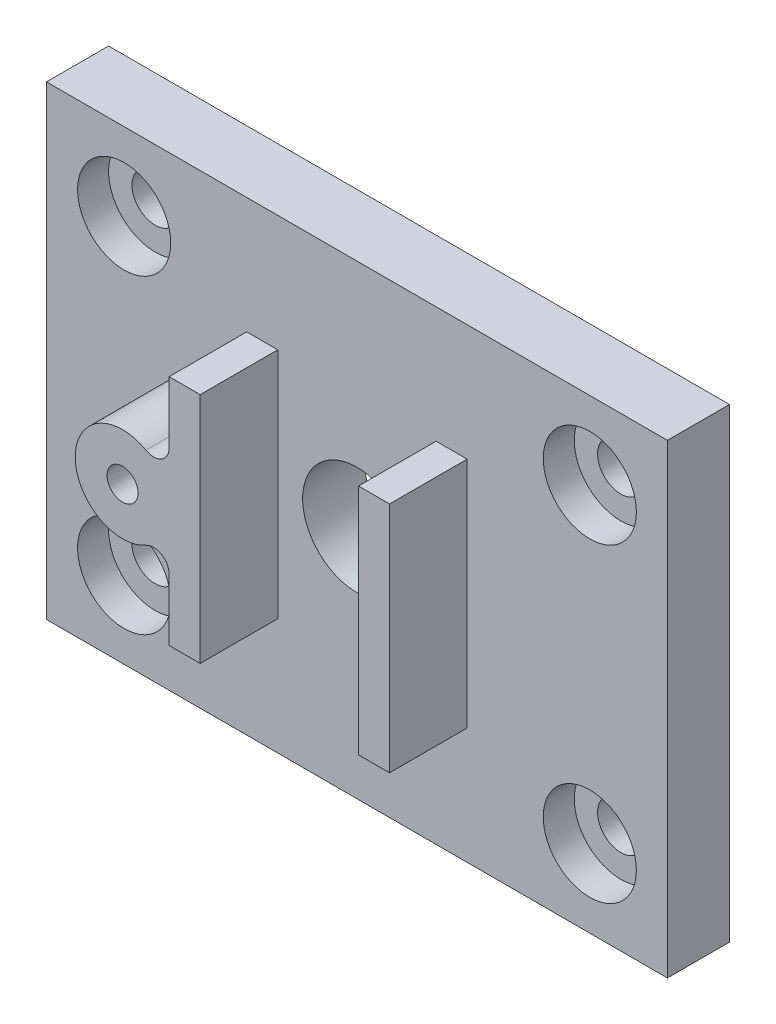
ISO-10303-21;
HEADER;
FILE_DESCRIPTION(('STEP AP214'),'2;1');
FILE_NAME('part.step','',(''),(''),'','','');
FILE_SCHEMA(('AUTOMOTIVE_DESIGN { 1 0 10303 214 1 1 1 1 }'));
ENDSEC;
DATA;
#1=APPLICATION_CONTEXT('core data for automotive mechanical design processes');
#2=APPLICATION_PROTOCOL_DEFINITION('international standard','automotive_design',2000,#1);
#3=PRODUCT_CONTEXT('',#1,'mechanical');
#4=PRODUCT('Part','Part','',(#3));
#5=PRODUCT_RELATED_PRODUCT_CATEGORY('part','',(#4));
#6=PRODUCT_DEFINITION_FORMATION('','',#4);
#7=PRODUCT_DEFINITION_CONTEXT('part definition',#1,'design');
#8=PRODUCT_DEFINITION('design','',#6,#7);
#9=PRODUCT_DEFINITION_SHAPE('','',#8);
#10=(LENGTH_UNIT() NAMED_UNIT(*) SI_UNIT(.MILLI.,.METRE.));
#11=(NAMED_UNIT(*) PLANE_ANGLE_UNIT() SI_UNIT($,.RADIAN.));
#12=(NAMED_UNIT(*) SI_UNIT($,.STERADIAN.) SOLID_ANGLE_UNIT());
#13=UNCERTAINTY_MEASURE_WITH_UNIT(LENGTH_MEASURE(1.E-05),#10,'distance_accuracy_value','');
#14=(GEOMETRIC_REPRESENTATION_CONTEXT(3) GLOBAL_UNCERTAINTY_ASSIGNED_CONTEXT((#13)) GLOBAL_UNIT_ASSIGNED_CONTEXT((#10,
#11,#12)) REPRESENTATION_CONTEXT('',''));
#15=CARTESIAN_POINT('',(0.,0.,0.));
#16=DIRECTION('',(0.,0.,1.));
#17=DIRECTION('',(1.,0.,0.));
#18=AXIS2_PLACEMENT_3D('',#15,#16,#17);
#19=CARTESIAN_POINT('',(0.,0.,4.));
#20=DIRECTION('',(0.,0.,1.));
#21=DIRECTION('',(1.,0.,0.));
#22=AXIS2_PLACEMENT_3D('',#19,#20,#21);
#23=PLANE('',#22);
#24=DIRECTION('',(0.,1.,0.));
#25=VECTOR('',#24,1.);
#26=CARTESIAN_POINT('',(25.1,0.,4.));
#27=LINE('',#26,#25);
#28=CARTESIAN_POINT('',(25.1,7.50000000000001,4.));
#29=VERTEX_POINT('',#28);
#30=CARTESIAN_POINT('',(25.1,22.5,4.));
#31=VERTEX_POINT('',#30);
#32=EDGE_CURVE('E154',#29,#31,#27,.T.);
#33=ORIENTED_EDGE('',*,*,#32,.T.);
#34=DIRECTION('',(1.,0.,0.));
#35=VECTOR('',#34,1.);
#36=CARTESIAN_POINT('',(0.,22.5,4.));
#37=LINE('',#36,#35);
#38=CARTESIAN_POINT('',(27.1,22.5,4.));
#39=VERTEX_POINT('',#38);
#40=EDGE_CURVE('E169',#31,#39,#37,.T.);
#41=ORIENTED_EDGE('',*,*,#40,.T.);
#42=DIRECTION('',(0.,-1.,0.));
#43=VECTOR('',#42,1.);
#44=CARTESIAN_POINT('',(27.1,0.,4.));
#45=LINE('',#44,#43);
#46=CARTESIAN_POINT('',(27.1,7.50000000000001,4.));
#47=VERTEX_POINT('',#46);
#48=EDGE_CURVE('E182',#39,#47,#45,.T.);
#49=ORIENTED_EDGE('',*,*,#48,.T.);
#50=DIRECTION('',(-1.,0.,0.));
#51=VECTOR('',#50,1.);
#52=CARTESIAN_POINT('',(0.,7.50000000000001,4.));
#53=LINE('',#52,#51);
#54=EDGE_CURVE('E180',#47,#29,#53,.T.);
#55=ORIENTED_EDGE('',*,*,#54,.T.);
#56=EDGE_LOOP('',(#33,#41,#49,#55));
#57=FACE_BOUND('',#56,.T.);
#58=DIRECTION('',(1.,0.,0.));
#59=VECTOR('',#58,1.);
#60=CARTESIAN_POINT('',(0.,0.,4.));
#61=LINE('',#60,#59);
#62=CARTESIAN_POINT('',(0.,0.,4.));
#63=VERTEX_POINT('',#62);
#64=CARTESIAN_POINT('',(40.,0.,4.));
#65=VERTEX_POINT('',#64);
#66=EDGE_CURVE('E268',#63,#65,#61,.T.);
#67=ORIENTED_EDGE('',*,*,#66,.T.);
#68=DIRECTION('',(0.,1.,0.));
#69=VECTOR('',#68,1.);
#70=CARTESIAN_POINT('',(40.,0.,4.));
#71=LINE('',#70,#69);
#72=CARTESIAN_POINT('',(40.,30.,4.));
#73=VERTEX_POINT('',#72);
#74=EDGE_CURVE('E271',#65,#73,#71,.T.);
#75=ORIENTED_EDGE('',*,*,#74,.T.);
#76=DIRECTION('',(1.,0.,0.));
#77=VECTOR('',#76,1.);
#78=CARTESIAN_POINT('',(0.,30.,4.));
#79=LINE('',#78,#77);
#80=CARTESIAN_POINT('',(0.,30.,4.));
#81=VERTEX_POINT('',#80);
#82=EDGE_CURVE('E273',#81,#73,#79,.T.);
#83=ORIENTED_EDGE('',*,*,#82,.F.);
#84=DIRECTION('',(0.,1.,0.));
#85=VECTOR('',#84,1.);
#86=CARTESIAN_POINT('',(0.,0.,4.));
#87=LINE('',#86,#85);
#88=EDGE_CURVE('E276',#63,#81,#87,.T.);
#89=ORIENTED_EDGE('',*,*,#88,.F.);
#90=EDGE_LOOP('',(#67,#75,#83,#89));
#91=FACE_BOUND('',#90,.T.);
#92=CARTESIAN_POINT('',(20.,15.,4.));
#93=DIRECTION('',(0.,0.,1.));
#94=DIRECTION('',(1.,0.,0.));
#95=AXIS2_PLACEMENT_3D('',#92,#93,#94);
#96=CIRCLE('',#95,3.5);
#97=CARTESIAN_POINT('',(23.5,15.,4.));
#98=VERTEX_POINT('',#97);
#99=EDGE_CURVE('E265',#98,#98,#96,.T.);
#100=ORIENTED_EDGE('',*,*,#99,.F.);
#101=EDGE_LOOP('',(#100));
#102=FACE_BOUND('',#101,.T.);
#103=CARTESIAN_POINT('',(5.,25.,4.));
#104=DIRECTION('',(0.,0.,1.));
#105=DIRECTION('',(1.,0.,0.));
#106=AXIS2_PLACEMENT_3D('',#103,#104,#105);
#107=CIRCLE('',#106,3.);
#108=CARTESIAN_POINT('',(8.,25.,4.));
#109=VERTEX_POINT('',#108);
#110=EDGE_CURVE('E262',#109,#109,#107,.T.);
#111=ORIENTED_EDGE('',*,*,#110,.F.);
#112=EDGE_LOOP('',(#111));
#113=FACE_BOUND('',#112,.T.);
#114=CARTESIAN_POINT('',(35.,25.,4.));
#115=DIRECTION('',(0.,0.,1.));
#116=DIRECTION('',(1.,0.,0.));
#117=AXIS2_PLACEMENT_3D('',#114,#115,#116);
#118=CIRCLE('',#117,3.);
#119=CARTESIAN_POINT('',(38.,25.,4.));
#120=VERTEX_POINT('',#119);
#121=EDGE_CURVE('E259',#120,#120,#118,.T.);
#122=ORIENTED_EDGE('',*,*,#121,.F.);
#123=EDGE_LOOP('',(#122));
#124=FACE_BOUND('',#123,.T.);
#125=CARTESIAN_POINT('',(35.,5.,4.));
#126=DIRECTION('',(0.,0.,1.));
#127=DIRECTION('',(1.,0.,0.));
#128=AXIS2_PLACEMENT_3D('',#125,#126,#127);
#129=CIRCLE('',#128,3.);
#130=CARTESIAN_POINT('',(38.,5.,4.));
#131=VERTEX_POINT('',#130);
#132=EDGE_CURVE('E255',#131,#131,#129,.T.);
#133=ORIENTED_EDGE('',*,*,#132,.F.);
#134=EDGE_LOOP('',(#133));
#135=FACE_BOUND('',#134,.T.);
#136=CARTESIAN_POINT('',(5.,5.,4.));
#137=DIRECTION('',(0.,0.,1.));
#138=DIRECTION('',(1.,0.,0.));
#139=AXIS2_PLACEMENT_3D('',#136,#137,#138);
#140=CIRCLE('',#139,3.);
#141=CARTESIAN_POINT('',(8.,5.,4.));
#142=VERTEX_POINT('',#141);
#143=EDGE_CURVE('E252',#142,#142,#140,.T.);
#144=ORIENTED_EDGE('',*,*,#143,.F.);
#145=EDGE_LOOP('',(#144));
#146=FACE_BOUND('',#145,.T.);
#147=CARTESIAN_POINT('',(9.9,15.,4.));
#148=DIRECTION('',(0.,0.,1.));
#149=DIRECTION('',(1.,0.,0.));
#150=AXIS2_PLACEMENT_3D('',#147,#148,#149);
#151=CIRCLE('',#150,3.05);
#152=CARTESIAN_POINT('',(11.4061728395062,17.6521582489614,4.));
#153=VERTEX_POINT('',#152);
#154=CARTESIAN_POINT('',(11.4061728395062,12.3478417510386,4.));
#155=VERTEX_POINT('',#154);
#156=EDGE_CURVE('E158',#153,#155,#151,.T.);
#157=ORIENTED_EDGE('',*,*,#156,.F.);
#158=CARTESIAN_POINT('',(11.9,18.5217183305881,4.));
#159=DIRECTION('',(0.,0.,1.));
#160=DIRECTION('',(1.,0.,0.));
#161=AXIS2_PLACEMENT_3D('',#158,#159,#160);
#162=CIRCLE('',#161,1.);
#163=CARTESIAN_POINT('',(12.9,18.5217183305881,4.));
#164=VERTEX_POINT('',#163);
#165=EDGE_CURVE('E323',#153,#164,#162,.T.);
#166=ORIENTED_EDGE('',*,*,#165,.T.);
#167=DIRECTION('',(0.,-1.,0.));
#168=VECTOR('',#167,1.);
#169=CARTESIAN_POINT('',(12.9,0.,4.));
#170=LINE('',#169,#168);
#171=CARTESIAN_POINT('',(12.9,22.5,4.));
#172=VERTEX_POINT('',#171);
#173=EDGE_CURVE('E194',#172,#164,#170,.T.);
#174=ORIENTED_EDGE('',*,*,#173,.F.);
#175=DIRECTION('',(-1.,0.,0.));
#176=VECTOR('',#175,1.);
#177=CARTESIAN_POINT('',(0.,22.5,4.));
#178=LINE('',#177,#176);
#179=CARTESIAN_POINT('',(14.9,22.5,4.));
#180=VERTEX_POINT('',#179);
#181=EDGE_CURVE('E213',#180,#172,#178,.T.);
#182=ORIENTED_EDGE('',*,*,#181,.F.);
#183=DIRECTION('',(0.,1.,0.));
#184=VECTOR('',#183,1.);
#185=CARTESIAN_POINT('',(14.9,0.,4.));
#186=LINE('',#185,#184);
#187=CARTESIAN_POINT('',(14.9,7.49999999999999,4.));
#188=VERTEX_POINT('',#187);
#189=EDGE_CURVE('E211',#188,#180,#186,.T.);
#190=ORIENTED_EDGE('',*,*,#189,.F.);
#191=DIRECTION('',(1.,0.,0.));
#192=VECTOR('',#191,1.);
#193=CARTESIAN_POINT('',(0.,7.49999999999999,4.));
#194=LINE('',#193,#192);
#195=CARTESIAN_POINT('',(12.9,7.49999999999999,4.));
#196=VERTEX_POINT('',#195);
#197=EDGE_CURVE('E209',#196,#188,#194,.T.);
#198=ORIENTED_EDGE('',*,*,#197,.F.);
#199=CARTESIAN_POINT('',(12.9,11.4782816694119,4.));
#200=VERTEX_POINT('',#199);
#201=EDGE_CURVE('E207',#200,#196,#170,.T.);
#202=ORIENTED_EDGE('',*,*,#201,.F.);
#203=CARTESIAN_POINT('',(11.9,11.4782816694119,4.));
#204=DIRECTION('',(0.,0.,1.));
#205=DIRECTION('',(1.,0.,0.));
#206=AXIS2_PLACEMENT_3D('',#203,#204,#205);
#207=CIRCLE('',#206,1.);
#208=EDGE_CURVE('E321',#200,#155,#207,.T.);
#209=ORIENTED_EDGE('',*,*,#208,.T.);
#210=EDGE_LOOP('',(#157,#166,#174,#182,#190,#198,#202,#209));
#211=FACE_BOUND('',#210,.T.);
#212=ADVANCED_FACE('F33',(#57,#91,#102,#113,#124,#135,#146,#211),#23,.T.);
#213=CARTESIAN_POINT('',(0.,0.,4.));
#214=DIRECTION('',(0.,1.,0.));
#215=DIRECTION('',(-1.,0.,0.));
#216=AXIS2_PLACEMENT_3D('',#213,#214,#215);
#217=PLANE('',#216);
#218=DIRECTION('',(1.,0.,0.));
#219=VECTOR('',#218,1.);
#220=CARTESIAN_POINT('',(0.,0.,0.));
#221=LINE('',#220,#219);
#222=CARTESIAN_POINT('',(0.,0.,0.));
#223=VERTEX_POINT('',#222);
#224=CARTESIAN_POINT('',(40.,0.,0.));
#225=VERTEX_POINT('',#224);
#226=EDGE_CURVE('E282',#223,#225,#221,.T.);
#227=ORIENTED_EDGE('',*,*,#226,.T.);
#228=DIRECTION('',(0.,0.,-1.));
#229=VECTOR('',#228,1.);
#230=CARTESIAN_POINT('',(40.,0.,4.));
#231=LINE('',#230,#229);
#232=EDGE_CURVE('E298',#65,#225,#231,.T.);
#233=ORIENTED_EDGE('',*,*,#232,.F.);
#234=ORIENTED_EDGE('',*,*,#66,.F.);
#235=DIRECTION('',(0.,0.,-1.));
#236=VECTOR('',#235,1.);
#237=CARTESIAN_POINT('',(0.,0.,4.));
#238=LINE('',#237,#236);
#239=EDGE_CURVE('E279',#63,#223,#238,.T.);
#240=ORIENTED_EDGE('',*,*,#239,.T.);
#241=EDGE_LOOP('',(#227,#233,#234,#240));
#242=FACE_BOUND('',#241,.T.);
#243=ADVANCED_FACE('F367',(#242),#217,.F.);
#244=CARTESIAN_POINT('',(40.,0.,4.));
#245=DIRECTION('',(-1.,0.,0.));
#246=DIRECTION('',(0.,-1.,0.));
#247=AXIS2_PLACEMENT_3D('',#244,#245,#246);
#248=PLANE('',#247);
#249=DIRECTION('',(0.,1.,0.));
#250=VECTOR('',#249,1.);
#251=CARTESIAN_POINT('',(40.,0.,0.));
#252=LINE('',#251,#250);
#253=CARTESIAN_POINT('',(40.,30.,0.));
#254=VERTEX_POINT('',#253);
#255=EDGE_CURVE('E285',#225,#254,#252,.T.);
#256=ORIENTED_EDGE('',*,*,#255,.T.);
#257=DIRECTION('',(0.,0.,-1.));
#258=VECTOR('',#257,1.);
#259=CARTESIAN_POINT('',(40.,30.,4.));
#260=LINE('',#259,#258);
#261=EDGE_CURVE('E296',#73,#254,#260,.T.);
#262=ORIENTED_EDGE('',*,*,#261,.F.);
#263=ORIENTED_EDGE('',*,*,#74,.F.);
#264=ORIENTED_EDGE('',*,*,#232,.T.);
#265=EDGE_LOOP('',(#256,#262,#263,#264));
#266=FACE_BOUND('',#265,.T.);
#267=ADVANCED_FACE('F374',(#266),#248,.F.);
#268=CARTESIAN_POINT('',(0.,30.,4.));
#269=DIRECTION('',(0.,1.,0.));
#270=DIRECTION('',(-1.,0.,0.));
#271=AXIS2_PLACEMENT_3D('',#268,#269,#270);
#272=PLANE('',#271);
#273=DIRECTION('',(1.,0.,0.));
#274=VECTOR('',#273,1.);
#275=CARTESIAN_POINT('',(0.,30.,0.));
#276=LINE('',#275,#274);
#277=CARTESIAN_POINT('',(0.,30.,0.));
#278=VERTEX_POINT('',#277);
#279=EDGE_CURVE('E288',#278,#254,#276,.T.);
#280=ORIENTED_EDGE('',*,*,#279,.F.);
#281=DIRECTION('',(0.,0.,-1.));
#282=VECTOR('',#281,1.);
#283=CARTESIAN_POINT('',(0.,30.,4.));
#284=LINE('',#283,#282);
#285=EDGE_CURVE('E294',#81,#278,#284,.T.);
#286=ORIENTED_EDGE('',*,*,#285,.F.);
#287=ORIENTED_EDGE('',*,*,#82,.T.);
#288=ORIENTED_EDGE('',*,*,#261,.T.);
#289=EDGE_LOOP('',(#280,#286,#287,#288));
#290=FACE_BOUND('',#289,.T.);
#291=ADVANCED_FACE('F490',(#290),#272,.T.);
#292=CARTESIAN_POINT('',(20.,15.,4.));
#293=DIRECTION('',(0.,0.,-1.));
#294=DIRECTION('',(-1.,0.,0.));
#295=AXIS2_PLACEMENT_3D('',#292,#293,#294);
#296=CYLINDRICAL_SURFACE('',#295,3.5);
#297=ORIENTED_EDGE('',*,*,#99,.T.);
#298=EDGE_LOOP('',(#297));
#299=FACE_BOUND('',#298,.T.);
#300=CARTESIAN_POINT('',(20.,15.,0.));
#301=DIRECTION('',(0.,0.,1.));
#302=DIRECTION('',(1.,0.,0.));
#303=AXIS2_PLACEMENT_3D('',#300,#301,#302);
#304=CIRCLE('',#303,3.5);
#305=CARTESIAN_POINT('',(23.5,15.,0.));
#306=VERTEX_POINT('',#305);
#307=EDGE_CURVE('E249',#306,#306,#304,.T.);
#308=ORIENTED_EDGE('',*,*,#307,.F.);
#309=EDGE_LOOP('',(#308));
#310=FACE_BOUND('',#309,.T.);
#311=ADVANCED_FACE('F460',(#299,#310),#296,.F.);
#312=CARTESIAN_POINT('',(5.,25.,4.));
#313=DIRECTION('',(0.,0.,-1.));
#314=DIRECTION('',(-1.,0.,0.));
#315=AXIS2_PLACEMENT_3D('',#312,#313,#314);
#316=CYLINDRICAL_SURFACE('',#315,3.);
#317=CARTESIAN_POINT('',(5.,25.,2.));
#318=DIRECTION('',(0.,0.,1.));
#319=DIRECTION('',(1.,0.,0.));
#320=AXIS2_PLACEMENT_3D('',#317,#318,#319);
#321=CIRCLE('',#320,3.);
#322=CARTESIAN_POINT('',(8.,25.,2.));
#323=VERTEX_POINT('',#322);
#324=EDGE_CURVE('E301',#323,#323,#321,.T.);
#325=ORIENTED_EDGE('',*,*,#324,.F.);
#326=EDGE_LOOP('',(#325));
#327=FACE_BOUND('',#326,.T.);
#328=ORIENTED_EDGE('',*,*,#110,.T.);
#329=EDGE_LOOP('',(#328));
#330=FACE_BOUND('',#329,.T.);
#331=ADVANCED_FACE('F456',(#327,#330),#316,.F.);
#332=CARTESIAN_POINT('',(35.,25.,4.));
#333=DIRECTION('',(0.,0.,-1.));
#334=DIRECTION('',(-1.,0.,0.));
#335=AXIS2_PLACEMENT_3D('',#332,#333,#334);
#336=CYLINDRICAL_SURFACE('',#335,3.);
#337=CARTESIAN_POINT('',(35.,25.,2.));
#338=DIRECTION('',(0.,0.,1.));
#339=DIRECTION('',(1.,0.,0.));
#340=AXIS2_PLACEMENT_3D('',#337,#338,#339);
#341=CIRCLE('',#340,3.);
#342=CARTESIAN_POINT('',(38.,25.,2.));
#343=VERTEX_POINT('',#342);
#344=EDGE_CURVE('E304',#343,#343,#341,.T.);
#345=ORIENTED_EDGE('',*,*,#344,.F.);
#346=EDGE_LOOP('',(#345));
#347=FACE_BOUND('',#346,.T.);
#348=ORIENTED_EDGE('',*,*,#121,.T.);
#349=EDGE_LOOP('',(#348));
#350=FACE_BOUND('',#349,.T.);
#351=ADVANCED_FACE('F459',(#347,#350),#336,.F.);
#352=CARTESIAN_POINT('',(35.,5.,4.));
#353=DIRECTION('',(0.,0.,-1.));
#354=DIRECTION('',(-1.,0.,0.));
#355=AXIS2_PLACEMENT_3D('',#352,#353,#354);
#356=CYLINDRICAL_SURFACE('',#355,3.);
#357=CARTESIAN_POINT('',(35.,5.,2.));
#358=DIRECTION('',(0.,0.,1.));
#359=DIRECTION('',(1.,0.,0.));
#360=AXIS2_PLACEMENT_3D('',#357,#358,#359);
#361=CIRCLE('',#360,3.);
#362=CARTESIAN_POINT('',(38.,5.,2.));
#363=VERTEX_POINT('',#362);
#364=EDGE_CURVE('E307',#363,#363,#361,.T.);
#365=ORIENTED_EDGE('',*,*,#364,.F.);
#366=EDGE_LOOP('',(#365));
#367=FACE_BOUND('',#366,.T.);
#368=ORIENTED_EDGE('',*,*,#132,.T.);
#369=EDGE_LOOP('',(#368));
#370=FACE_BOUND('',#369,.T.);
#371=ADVANCED_FACE('F473',(#367,#370),#356,.F.);
#372=CARTESIAN_POINT('',(5.,5.,4.));
#373=DIRECTION('',(0.,0.,-1.));
#374=DIRECTION('',(-1.,0.,0.));
#375=AXIS2_PLACEMENT_3D('',#372,#373,#374);
#376=CYLINDRICAL_SURFACE('',#375,3.);
#377=CARTESIAN_POINT('',(5.,5.,2.));
#378=DIRECTION('',(0.,0.,1.));
#379=DIRECTION('',(1.,0.,0.));
#380=AXIS2_PLACEMENT_3D('',#377,#378,#379);
#381=CIRCLE('',#380,3.);
#382=CARTESIAN_POINT('',(8.,5.,2.));
#383=VERTEX_POINT('',#382);
#384=EDGE_CURVE('E310',#383,#383,#381,.T.);
#385=ORIENTED_EDGE('',*,*,#384,.F.);
#386=EDGE_LOOP('',(#385));
#387=FACE_BOUND('',#386,.T.);
#388=ORIENTED_EDGE('',*,*,#143,.T.);
#389=EDGE_LOOP('',(#388));
#390=FACE_BOUND('',#389,.T.);
#391=ADVANCED_FACE('F471',(#387,#390),#376,.F.);
#392=CARTESIAN_POINT('',(0.,0.,4.));
#393=DIRECTION('',(-1.,0.,0.));
#394=DIRECTION('',(0.,-1.,0.));
#395=AXIS2_PLACEMENT_3D('',#392,#393,#394);
#396=PLANE('',#395);
#397=DIRECTION('',(0.,1.,0.));
#398=VECTOR('',#397,1.);
#399=CARTESIAN_POINT('',(0.,0.,0.));
#400=LINE('',#399,#398);
#401=EDGE_CURVE('E256',#223,#278,#400,.T.);
#402=ORIENTED_EDGE('',*,*,#401,.F.);
#403=ORIENTED_EDGE('',*,*,#239,.F.);
#404=ORIENTED_EDGE('',*,*,#88,.T.);
#405=ORIENTED_EDGE('',*,*,#285,.T.);
#406=EDGE_LOOP('',(#402,#403,#404,#405));
#407=FACE_BOUND('',#406,.T.);
#408=ADVANCED_FACE('F438',(#407),#396,.T.);
#409=CARTESIAN_POINT('',(0.,0.,0.));
#410=DIRECTION('',(0.,0.,1.));
#411=DIRECTION('',(1.,0.,0.));
#412=AXIS2_PLACEMENT_3D('',#409,#410,#411);
#413=PLANE('',#412);
#414=ORIENTED_EDGE('',*,*,#307,.T.);
#415=EDGE_LOOP('',(#414));
#416=FACE_BOUND('',#415,.T.);
#417=ORIENTED_EDGE('',*,*,#226,.F.);
#418=ORIENTED_EDGE('',*,*,#401,.T.);
#419=ORIENTED_EDGE('',*,*,#279,.T.);
#420=ORIENTED_EDGE('',*,*,#255,.F.);
#421=EDGE_LOOP('',(#417,#418,#419,#420));
#422=FACE_BOUND('',#421,.T.);
#423=CARTESIAN_POINT('',(5.,25.,0.));
#424=DIRECTION('',(0.,0.,1.));
#425=DIRECTION('',(1.,0.,0.));
#426=AXIS2_PLACEMENT_3D('',#423,#424,#425);
#427=CIRCLE('',#426,1.5);
#428=CARTESIAN_POINT('',(6.5,25.,0.));
#429=VERTEX_POINT('',#428);
#430=EDGE_CURVE('E243',#429,#429,#427,.T.);
#431=ORIENTED_EDGE('',*,*,#430,.T.);
#432=EDGE_LOOP('',(#431));
#433=FACE_BOUND('',#432,.T.);
#434=CARTESIAN_POINT('',(35.,25.,0.));
#435=DIRECTION('',(0.,0.,1.));
#436=DIRECTION('',(1.,0.,0.));
#437=AXIS2_PLACEMENT_3D('',#434,#435,#436);
#438=CIRCLE('',#437,1.5);
#439=CARTESIAN_POINT('',(36.5,25.,0.));
#440=VERTEX_POINT('',#439);
#441=EDGE_CURVE('E237',#440,#440,#438,.T.);
#442=ORIENTED_EDGE('',*,*,#441,.T.);
#443=EDGE_LOOP('',(#442));
#444=FACE_BOUND('',#443,.T.);
#445=CARTESIAN_POINT('',(35.,5.,0.));
#446=DIRECTION('',(0.,0.,1.));
#447=DIRECTION('',(1.,0.,0.));
#448=AXIS2_PLACEMENT_3D('',#445,#446,#447);
#449=CIRCLE('',#448,1.5);
#450=CARTESIAN_POINT('',(36.5,5.,0.));
#451=VERTEX_POINT('',#450);
#452=EDGE_CURVE('E231',#451,#451,#449,.T.);
#453=ORIENTED_EDGE('',*,*,#452,.T.);
#454=EDGE_LOOP('',(#453));
#455=FACE_BOUND('',#454,.T.);
#456=CARTESIAN_POINT('',(5.,5.,0.));
#457=DIRECTION('',(0.,0.,1.));
#458=DIRECTION('',(1.,0.,0.));
#459=AXIS2_PLACEMENT_3D('',#456,#457,#458);
#460=CIRCLE('',#459,1.5);
#461=CARTESIAN_POINT('',(6.5,5.,0.));
#462=VERTEX_POINT('',#461);
#463=EDGE_CURVE('E227',#462,#462,#460,.T.);
#464=ORIENTED_EDGE('',*,*,#463,.T.);
#465=EDGE_LOOP('',(#464));
#466=FACE_BOUND('',#465,.T.);
#467=ADVANCED_FACE('F433',(#416,#422,#433,#444,#455,#466),#413,.F.);
#468=CARTESIAN_POINT('',(5.,25.,2.));
#469=DIRECTION('',(0.,0.,-1.));
#470=DIRECTION('',(-1.,0.,0.));
#471=AXIS2_PLACEMENT_3D('',#468,#469,#470);
#472=CYLINDRICAL_SURFACE('',#471,1.5);
#473=CARTESIAN_POINT('',(5.,25.,2.));
#474=DIRECTION('',(0.,0.,1.));
#475=DIRECTION('',(1.,0.,0.));
#476=AXIS2_PLACEMENT_3D('',#473,#474,#475);
#477=CIRCLE('',#476,1.5);
#478=CARTESIAN_POINT('',(6.5,25.,2.));
#479=VERTEX_POINT('',#478);
#480=EDGE_CURVE('E246',#479,#479,#477,.T.);
#481=ORIENTED_EDGE('',*,*,#480,.T.);
#482=EDGE_LOOP('',(#481));
#483=FACE_BOUND('',#482,.T.);
#484=ORIENTED_EDGE('',*,*,#430,.F.);
#485=EDGE_LOOP('',(#484));
#486=FACE_BOUND('',#485,.T.);
#487=ADVANCED_FACE('F430',(#483,#486),#472,.F.);
#488=CARTESIAN_POINT('',(0.,0.,2.));
#489=DIRECTION('',(0.,0.,1.));
#490=DIRECTION('',(1.,0.,0.));
#491=AXIS2_PLACEMENT_3D('',#488,#489,#490);
#492=PLANE('',#491);
#493=ORIENTED_EDGE('',*,*,#480,.F.);
#494=EDGE_LOOP('',(#493));
#495=FACE_BOUND('',#494,.T.);
#496=ORIENTED_EDGE('',*,*,#324,.T.);
#497=EDGE_LOOP('',(#496));
#498=FACE_BOUND('',#497,.T.);
#499=ADVANCED_FACE('F427',(#495,#498),#492,.T.);
#500=CARTESIAN_POINT('',(35.,25.,2.));
#501=DIRECTION('',(0.,0.,-1.));
#502=DIRECTION('',(-1.,0.,0.));
#503=AXIS2_PLACEMENT_3D('',#500,#501,#502);
#504=CYLINDRICAL_SURFACE('',#503,1.5);
#505=CARTESIAN_POINT('',(35.,25.,2.));
#506=DIRECTION('',(0.,0.,1.));
#507=DIRECTION('',(1.,0.,0.));
#508=AXIS2_PLACEMENT_3D('',#505,#506,#507);
#509=CIRCLE('',#508,1.5);
#510=CARTESIAN_POINT('',(36.5,25.,2.));
#511=VERTEX_POINT('',#510);
#512=EDGE_CURVE('E240',#511,#511,#509,.T.);
#513=ORIENTED_EDGE('',*,*,#512,.T.);
#514=EDGE_LOOP('',(#513));
#515=FACE_BOUND('',#514,.T.);
#516=ORIENTED_EDGE('',*,*,#441,.F.);
#517=EDGE_LOOP('',(#516));
#518=FACE_BOUND('',#517,.T.);
#519=ADVANCED_FACE('F423',(#515,#518),#504,.F.);
#520=CARTESIAN_POINT('',(0.,0.,2.));
#521=DIRECTION('',(0.,0.,1.));
#522=DIRECTION('',(1.,0.,0.));
#523=AXIS2_PLACEMENT_3D('',#520,#521,#522);
#524=PLANE('',#523);
#525=ORIENTED_EDGE('',*,*,#512,.F.);
#526=EDGE_LOOP('',(#525));
#527=FACE_BOUND('',#526,.T.);
#528=ORIENTED_EDGE('',*,*,#344,.T.);
#529=EDGE_LOOP('',(#528));
#530=FACE_BOUND('',#529,.T.);
#531=ADVANCED_FACE('F419',(#527,#530),#524,.T.);
#532=CARTESIAN_POINT('',(35.,5.,2.));
#533=DIRECTION('',(0.,0.,-1.));
#534=DIRECTION('',(-1.,0.,0.));
#535=AXIS2_PLACEMENT_3D('',#532,#533,#534);
#536=CYLINDRICAL_SURFACE('',#535,1.5);
#537=CARTESIAN_POINT('',(35.,5.,2.));
#538=DIRECTION('',(0.,0.,1.));
#539=DIRECTION('',(1.,0.,0.));
#540=AXIS2_PLACEMENT_3D('',#537,#538,#539);
#541=CIRCLE('',#540,1.5);
#542=CARTESIAN_POINT('',(36.5,5.,2.));
#543=VERTEX_POINT('',#542);
#544=EDGE_CURVE('E234',#543,#543,#541,.T.);
#545=ORIENTED_EDGE('',*,*,#544,.T.);
#546=EDGE_LOOP('',(#545));
#547=FACE_BOUND('',#546,.T.);
#548=ORIENTED_EDGE('',*,*,#452,.F.);
#549=EDGE_LOOP('',(#548));
#550=FACE_BOUND('',#549,.T.);
#551=ADVANCED_FACE('F415',(#547,#550),#536,.F.);
#552=CARTESIAN_POINT('',(0.,0.,2.));
#553=DIRECTION('',(0.,0.,1.));
#554=DIRECTION('',(1.,0.,0.));
#555=AXIS2_PLACEMENT_3D('',#552,#553,#554);
#556=PLANE('',#555);
#557=ORIENTED_EDGE('',*,*,#544,.F.);
#558=EDGE_LOOP('',(#557));
#559=FACE_BOUND('',#558,.T.);
#560=ORIENTED_EDGE('',*,*,#364,.T.);
#561=EDGE_LOOP('',(#560));
#562=FACE_BOUND('',#561,.T.);
#563=ADVANCED_FACE('F411',(#559,#562),#556,.T.);
#564=CARTESIAN_POINT('',(5.,5.,2.));
#565=DIRECTION('',(0.,0.,-1.));
#566=DIRECTION('',(-1.,0.,0.));
#567=AXIS2_PLACEMENT_3D('',#564,#565,#566);
#568=CYLINDRICAL_SURFACE('',#567,1.5);
#569=CARTESIAN_POINT('',(5.,5.,2.));
#570=DIRECTION('',(0.,0.,1.));
#571=DIRECTION('',(1.,0.,0.));
#572=AXIS2_PLACEMENT_3D('',#569,#570,#571);
#573=CIRCLE('',#572,1.5);
#574=CARTESIAN_POINT('',(6.5,5.,2.));
#575=VERTEX_POINT('',#574);
#576=EDGE_CURVE('E228',#575,#575,#573,.T.);
#577=ORIENTED_EDGE('',*,*,#576,.T.);
#578=EDGE_LOOP('',(#577));
#579=FACE_BOUND('',#578,.T.);
#580=ORIENTED_EDGE('',*,*,#463,.F.);
#581=EDGE_LOOP('',(#580));
#582=FACE_BOUND('',#581,.T.);
#583=ADVANCED_FACE('F407',(#579,#582),#568,.F.);
#584=CARTESIAN_POINT('',(0.,0.,2.));
#585=DIRECTION('',(0.,0.,1.));
#586=DIRECTION('',(1.,0.,0.));
#587=AXIS2_PLACEMENT_3D('',#584,#585,#586);
#588=PLANE('',#587);
#589=ORIENTED_EDGE('',*,*,#576,.F.);
#590=EDGE_LOOP('',(#589));
#591=FACE_BOUND('',#590,.T.);
#592=ORIENTED_EDGE('',*,*,#384,.T.);
#593=EDGE_LOOP('',(#592));
#594=FACE_BOUND('',#593,.T.);
#595=ADVANCED_FACE('F404',(#591,#594),#588,.T.);
#596=CARTESIAN_POINT('',(9.9,15.,9.));
#597=DIRECTION('',(0.,0.,-1.));
#598=DIRECTION('',(-1.,0.,0.));
#599=AXIS2_PLACEMENT_3D('',#596,#597,#598);
#600=CYLINDRICAL_SURFACE('',#599,3.05);
#601=CARTESIAN_POINT('',(9.9,15.,9.));
#602=DIRECTION('',(0.,0.,1.));
#603=DIRECTION('',(1.,0.,0.));
#604=AXIS2_PLACEMENT_3D('',#601,#602,#603);
#605=CIRCLE('',#604,3.05);
#606=CARTESIAN_POINT('',(11.4061728395062,17.6521582489614,9.));
#607=VERTEX_POINT('',#606);
#608=CARTESIAN_POINT('',(11.4061728395062,12.3478417510386,9.));
#609=VERTEX_POINT('',#608);
#610=EDGE_CURVE('E193',#607,#609,#605,.T.);
#611=ORIENTED_EDGE('',*,*,#610,.F.);
#612=DIRECTION('',(0.,0.,-1.));
#613=VECTOR('',#612,1.);
#614=CARTESIAN_POINT('',(11.4061728395062,17.6521582489614,9.));
#615=LINE('',#614,#613);
#616=EDGE_CURVE('E318',#607,#153,#615,.T.);
#617=ORIENTED_EDGE('',*,*,#616,.T.);
#618=ORIENTED_EDGE('',*,*,#156,.T.);
#619=DIRECTION('',(0.,0.,-1.));
#620=VECTOR('',#619,1.);
#621=CARTESIAN_POINT('',(11.4061728395062,12.3478417510386,9.));
#622=LINE('',#621,#620);
#623=EDGE_CURVE('E316',#155,#609,#622,.F.);
#624=ORIENTED_EDGE('',*,*,#623,.T.);
#625=EDGE_LOOP('',(#611,#617,#618,#624));
#626=FACE_BOUND('',#625,.T.);
#627=ADVANCED_FACE('F334',(#626),#600,.T.);
#628=CARTESIAN_POINT('',(12.9,0.,9.));
#629=DIRECTION('',(1.,0.,0.));
#630=DIRECTION('',(0.,1.,0.));
#631=AXIS2_PLACEMENT_3D('',#628,#629,#630);
#632=PLANE('',#631);
#633=DIRECTION('',(0.,-1.,0.));
#634=VECTOR('',#633,1.);
#635=CARTESIAN_POINT('',(12.9,0.,9.));
#636=LINE('',#635,#634);
#637=CARTESIAN_POINT('',(12.9,11.4782816694119,9.));
#638=VERTEX_POINT('',#637);
#639=CARTESIAN_POINT('',(12.9,7.49999999999999,9.));
#640=VERTEX_POINT('',#639);
#641=EDGE_CURVE('E196',#638,#640,#636,.T.);
#642=ORIENTED_EDGE('',*,*,#641,.F.);
#643=DIRECTION('',(0.,0.,1.));
#644=VECTOR('',#643,1.);
#645=CARTESIAN_POINT('',(12.9,11.4782816694119,4.));
#646=LINE('',#645,#644);
#647=EDGE_CURVE('E326',#638,#200,#646,.F.);
#648=ORIENTED_EDGE('',*,*,#647,.T.);
#649=ORIENTED_EDGE('',*,*,#201,.T.);
#650=DIRECTION('',(0.,0.,-1.));
#651=VECTOR('',#650,1.);
#652=CARTESIAN_POINT('',(12.9,7.49999999999999,9.));
#653=LINE('',#652,#651);
#654=EDGE_CURVE('E224',#640,#196,#653,.T.);
#655=ORIENTED_EDGE('',*,*,#654,.F.);
#656=EDGE_LOOP('',(#642,#648,#649,#655));
#657=FACE_BOUND('',#656,.T.);
#658=ADVANCED_FACE('F359',(#657),#632,.F.);
#659=CARTESIAN_POINT('',(0.,7.49999999999999,9.));
#660=DIRECTION('',(0.,1.,0.));
#661=DIRECTION('',(0.,0.,1.));
#662=AXIS2_PLACEMENT_3D('',#659,#660,#661);
#663=PLANE('',#662);
#664=ORIENTED_EDGE('',*,*,#197,.T.);
#665=DIRECTION('',(0.,0.,-1.));
#666=VECTOR('',#665,1.);
#667=CARTESIAN_POINT('',(14.9,7.49999999999999,9.));
#668=LINE('',#667,#666);
#669=CARTESIAN_POINT('',(14.9,7.49999999999999,9.));
#670=VERTEX_POINT('',#669);
#671=EDGE_CURVE('E221',#670,#188,#668,.T.);
#672=ORIENTED_EDGE('',*,*,#671,.F.);
#673=DIRECTION('',(1.,0.,0.));
#674=VECTOR('',#673,1.);
#675=CARTESIAN_POINT('',(0.,7.49999999999999,9.));
#676=LINE('',#675,#674);
#677=EDGE_CURVE('E198',#640,#670,#676,.T.);
#678=ORIENTED_EDGE('',*,*,#677,.F.);
#679=ORIENTED_EDGE('',*,*,#654,.T.);
#680=EDGE_LOOP('',(#664,#672,#678,#679));
#681=FACE_BOUND('',#680,.T.);
#682=ADVANCED_FACE('F356',(#681),#663,.F.);
#683=CARTESIAN_POINT('',(14.9,0.,9.));
#684=DIRECTION('',(-1.,0.,0.));
#685=DIRECTION('',(0.,0.,1.));
#686=AXIS2_PLACEMENT_3D('',#683,#684,#685);
#687=PLANE('',#686);
#688=ORIENTED_EDGE('',*,*,#189,.T.);
#689=DIRECTION('',(0.,0.,-1.));
#690=VECTOR('',#689,1.);
#691=CARTESIAN_POINT('',(14.9,22.5,9.));
#692=LINE('',#691,#690);
#693=CARTESIAN_POINT('',(14.9,22.5,9.));
#694=VERTEX_POINT('',#693);
#695=EDGE_CURVE('E218',#694,#180,#692,.T.);
#696=ORIENTED_EDGE('',*,*,#695,.F.);
#697=DIRECTION('',(0.,1.,0.));
#698=VECTOR('',#697,1.);
#699=CARTESIAN_POINT('',(14.9,0.,9.));
#700=LINE('',#699,#698);
#701=EDGE_CURVE('E201',#670,#694,#700,.T.);
#702=ORIENTED_EDGE('',*,*,#701,.F.);
#703=ORIENTED_EDGE('',*,*,#671,.T.);
#704=EDGE_LOOP('',(#688,#696,#702,#703));
#705=FACE_BOUND('',#704,.T.);
#706=ADVANCED_FACE('F351',(#705),#687,.F.);
#707=CARTESIAN_POINT('',(0.,22.5,9.));
#708=DIRECTION('',(0.,-1.,0.));
#709=DIRECTION('',(0.,0.,-1.));
#710=AXIS2_PLACEMENT_3D('',#707,#708,#709);
#711=PLANE('',#710);
#712=ORIENTED_EDGE('',*,*,#181,.T.);
#713=DIRECTION('',(0.,0.,-1.));
#714=VECTOR('',#713,1.);
#715=CARTESIAN_POINT('',(12.9,22.5,9.));
#716=LINE('',#715,#714);
#717=CARTESIAN_POINT('',(12.9,22.5,9.));
#718=VERTEX_POINT('',#717);
#719=EDGE_CURVE('E216',#718,#172,#716,.T.);
#720=ORIENTED_EDGE('',*,*,#719,.F.);
#721=DIRECTION('',(-1.,0.,0.));
#722=VECTOR('',#721,1.);
#723=CARTESIAN_POINT('',(0.,22.5,9.));
#724=LINE('',#723,#722);
#725=EDGE_CURVE('E203',#694,#718,#724,.T.);
#726=ORIENTED_EDGE('',*,*,#725,.F.);
#727=ORIENTED_EDGE('',*,*,#695,.T.);
#728=EDGE_LOOP('',(#712,#720,#726,#727));
#729=FACE_BOUND('',#728,.T.);
#730=ADVANCED_FACE('F345',(#729),#711,.F.);
#731=CARTESIAN_POINT('',(9.9,15.,9.));
#732=DIRECTION('',(0.,0.,-1.));
#733=DIRECTION('',(-1.,0.,0.));
#734=AXIS2_PLACEMENT_3D('',#731,#732,#733);
#735=CYLINDRICAL_SURFACE('',#734,0.999999999999999);
#736=CARTESIAN_POINT('',(9.9,15.,9.));
#737=DIRECTION('',(0.,0.,1.));
#738=DIRECTION('',(1.,0.,0.));
#739=AXIS2_PLACEMENT_3D('',#736,#737,#738);
#740=CIRCLE('',#739,0.999999999999999);
#741=CARTESIAN_POINT('',(10.9,15.,9.));
#742=VERTEX_POINT('',#741);
#743=EDGE_CURVE('E190',#742,#742,#740,.T.);
#744=ORIENTED_EDGE('',*,*,#743,.T.);
#745=EDGE_LOOP('',(#744));
#746=FACE_BOUND('',#745,.T.);
#747=CARTESIAN_POINT('',(9.9,15.,4.));
#748=DIRECTION('',(0.,0.,1.));
#749=DIRECTION('',(1.,0.,0.));
#750=AXIS2_PLACEMENT_3D('',#747,#748,#749);
#751=CIRCLE('',#750,0.999999999999999);
#752=CARTESIAN_POINT('',(10.9,15.,4.));
#753=VERTEX_POINT('',#752);
#754=EDGE_CURVE('E313',#753,#753,#751,.F.);
#755=ORIENTED_EDGE('',*,*,#754,.T.);
#756=EDGE_LOOP('',(#755));
#757=FACE_BOUND('',#756,.T.);
#758=ADVANCED_FACE('F391',(#746,#757),#735,.F.);
#759=ORIENTED_EDGE('',*,*,#173,.T.);
#760=DIRECTION('',(0.,0.,1.));
#761=VECTOR('',#760,1.);
#762=CARTESIAN_POINT('',(12.9,18.5217183305881,9.));
#763=LINE('',#762,#761);
#764=CARTESIAN_POINT('',(12.9,18.5217183305881,9.));
#765=VERTEX_POINT('',#764);
#766=EDGE_CURVE('E54',#164,#765,#763,.T.);
#767=ORIENTED_EDGE('',*,*,#766,.T.);
#768=EDGE_CURVE('E199',#718,#765,#636,.T.);
#769=ORIENTED_EDGE('',*,*,#768,.F.);
#770=ORIENTED_EDGE('',*,*,#719,.T.);
#771=EDGE_LOOP('',(#759,#767,#769,#770));
#772=FACE_BOUND('',#771,.T.);
#773=ADVANCED_FACE('F341',(#772),#632,.F.);
#774=CARTESIAN_POINT('',(0.,0.,9.));
#775=DIRECTION('',(0.,0.,1.));
#776=DIRECTION('',(1.,0.,0.));
#777=AXIS2_PLACEMENT_3D('',#774,#775,#776);
#778=PLANE('',#777);
#779=ORIENTED_EDGE('',*,*,#743,.F.);
#780=EDGE_LOOP('',(#779));
#781=FACE_BOUND('',#780,.T.);
#782=ORIENTED_EDGE('',*,*,#768,.T.);
#783=CARTESIAN_POINT('',(11.9,18.5217183305881,9.));
#784=DIRECTION('',(0.,0.,1.));
#785=DIRECTION('',(1.,0.,0.));
#786=AXIS2_PLACEMENT_3D('',#783,#784,#785);
#787=CIRCLE('',#786,1.);
#788=EDGE_CURVE('E41',#765,#607,#787,.F.);
#789=ORIENTED_EDGE('',*,*,#788,.T.);
#790=ORIENTED_EDGE('',*,*,#610,.T.);
#791=CARTESIAN_POINT('',(11.9,11.4782816694119,9.));
#792=DIRECTION('',(0.,0.,1.));
#793=DIRECTION('',(1.,0.,0.));
#794=AXIS2_PLACEMENT_3D('',#791,#792,#793);
#795=CIRCLE('',#794,1.);
#796=EDGE_CURVE('E11',#609,#638,#795,.F.);
#797=ORIENTED_EDGE('',*,*,#796,.T.);
#798=ORIENTED_EDGE('',*,*,#641,.T.);
#799=ORIENTED_EDGE('',*,*,#677,.T.);
#800=ORIENTED_EDGE('',*,*,#701,.T.);
#801=ORIENTED_EDGE('',*,*,#725,.T.);
#802=EDGE_LOOP('',(#782,#789,#790,#797,#798,#799,#800,#801));
#803=FACE_BOUND('',#802,.T.);
#804=ADVANCED_FACE('F330',(#781,#803),#778,.T.);
#805=ORIENTED_EDGE('',*,*,#754,.F.);
#806=EDGE_LOOP('',(#805));
#807=FACE_BOUND('',#806,.T.);
#808=ADVANCED_FACE('F370',(#807),#23,.T.);
#809=CARTESIAN_POINT('',(25.1,0.,9.));
#810=DIRECTION('',(-1.,0.,0.));
#811=DIRECTION('',(0.,0.,1.));
#812=AXIS2_PLACEMENT_3D('',#809,#810,#811);
#813=PLANE('',#812);
#814=ORIENTED_EDGE('',*,*,#32,.F.);
#815=DIRECTION('',(0.,0.,-1.));
#816=VECTOR('',#815,1.);
#817=CARTESIAN_POINT('',(25.1,7.50000000000001,9.));
#818=LINE('',#817,#816);
#819=CARTESIAN_POINT('',(25.1,7.50000000000001,9.));
#820=VERTEX_POINT('',#819);
#821=EDGE_CURVE('E148',#820,#29,#818,.T.);
#822=ORIENTED_EDGE('',*,*,#821,.F.);
#823=DIRECTION('',(0.,1.,0.));
#824=VECTOR('',#823,1.);
#825=CARTESIAN_POINT('',(25.1,0.,9.));
#826=LINE('',#825,#824);
#827=CARTESIAN_POINT('',(25.1,22.5,9.));
#828=VERTEX_POINT('',#827);
#829=EDGE_CURVE('E152',#820,#828,#826,.T.);
#830=ORIENTED_EDGE('',*,*,#829,.T.);
#831=DIRECTION('',(0.,0.,-1.));
#832=VECTOR('',#831,1.);
#833=CARTESIAN_POINT('',(25.1,22.5,9.));
#834=LINE('',#833,#832);
#835=EDGE_CURVE('E178',#828,#31,#834,.T.);
#836=ORIENTED_EDGE('',*,*,#835,.T.);
#837=EDGE_LOOP('',(#814,#822,#830,#836));
#838=FACE_BOUND('',#837,.T.);
#839=ADVANCED_FACE('F150',(#838),#813,.T.);
#840=CARTESIAN_POINT('',(0.,7.50000000000001,9.));
#841=DIRECTION('',(0.,-1.,0.));
#842=DIRECTION('',(0.,0.,-1.));
#843=AXIS2_PLACEMENT_3D('',#840,#841,#842);
#844=PLANE('',#843);
#845=ORIENTED_EDGE('',*,*,#54,.F.);
#846=DIRECTION('',(0.,0.,-1.));
#847=VECTOR('',#846,1.);
#848=CARTESIAN_POINT('',(27.1,7.50000000000001,9.));
#849=LINE('',#848,#847);
#850=CARTESIAN_POINT('',(27.1,7.50000000000001,9.));
#851=VERTEX_POINT('',#850);
#852=EDGE_CURVE('E159',#851,#47,#849,.T.);
#853=ORIENTED_EDGE('',*,*,#852,.F.);
#854=DIRECTION('',(-1.,0.,0.));
#855=VECTOR('',#854,1.);
#856=CARTESIAN_POINT('',(0.,7.50000000000001,9.));
#857=LINE('',#856,#855);
#858=EDGE_CURVE('E165',#851,#820,#857,.T.);
#859=ORIENTED_EDGE('',*,*,#858,.T.);
#860=ORIENTED_EDGE('',*,*,#821,.T.);
#861=EDGE_LOOP('',(#845,#853,#859,#860));
#862=FACE_BOUND('',#861,.T.);
#863=ADVANCED_FACE('F171',(#862),#844,.T.);
#864=CARTESIAN_POINT('',(27.1,0.,9.));
#865=DIRECTION('',(1.,0.,0.));
#866=DIRECTION('',(0.,1.,0.));
#867=AXIS2_PLACEMENT_3D('',#864,#865,#866);
#868=PLANE('',#867);
#869=ORIENTED_EDGE('',*,*,#48,.F.);
#870=DIRECTION('',(0.,0.,-1.));
#871=VECTOR('',#870,1.);
#872=CARTESIAN_POINT('',(27.1,22.5,9.));
#873=LINE('',#872,#871);
#874=CARTESIAN_POINT('',(27.1,22.5,9.));
#875=VERTEX_POINT('',#874);
#876=EDGE_CURVE('E186',#875,#39,#873,.T.);
#877=ORIENTED_EDGE('',*,*,#876,.F.);
#878=DIRECTION('',(0.,-1.,0.));
#879=VECTOR('',#878,1.);
#880=CARTESIAN_POINT('',(27.1,0.,9.));
#881=LINE('',#880,#879);
#882=EDGE_CURVE('E173',#875,#851,#881,.T.);
#883=ORIENTED_EDGE('',*,*,#882,.T.);
#884=ORIENTED_EDGE('',*,*,#852,.T.);
#885=EDGE_LOOP('',(#869,#877,#883,#884));
#886=FACE_BOUND('',#885,.T.);
#887=ADVANCED_FACE('F642',(#886),#868,.T.);
#888=CARTESIAN_POINT('',(0.,22.5,9.));
#889=DIRECTION('',(0.,1.,0.));
#890=DIRECTION('',(0.,0.,1.));
#891=AXIS2_PLACEMENT_3D('',#888,#889,#890);
#892=PLANE('',#891);
#893=ORIENTED_EDGE('',*,*,#40,.F.);
#894=ORIENTED_EDGE('',*,*,#835,.F.);
#895=DIRECTION('',(1.,0.,0.));
#896=VECTOR('',#895,1.);
#897=CARTESIAN_POINT('',(0.,22.5,9.));
#898=LINE('',#897,#896);
#899=EDGE_CURVE('E168',#828,#875,#898,.T.);
#900=ORIENTED_EDGE('',*,*,#899,.T.);
#901=ORIENTED_EDGE('',*,*,#876,.T.);
#902=EDGE_LOOP('',(#893,#894,#900,#901));
#903=FACE_BOUND('',#902,.T.);
#904=ADVANCED_FACE('F651',(#903),#892,.T.);
#905=CARTESIAN_POINT('',(0.,0.,9.));
#906=DIRECTION('',(0.,0.,1.));
#907=DIRECTION('',(1.,0.,0.));
#908=AXIS2_PLACEMENT_3D('',#905,#906,#907);
#909=PLANE('',#908);
#910=ORIENTED_EDGE('',*,*,#829,.F.);
#911=ORIENTED_EDGE('',*,*,#858,.F.);
#912=ORIENTED_EDGE('',*,*,#882,.F.);
#913=ORIENTED_EDGE('',*,*,#899,.F.);
#914=EDGE_LOOP('',(#910,#911,#912,#913));
#915=FACE_BOUND('',#914,.T.);
#916=ADVANCED_FACE('F163',(#915),#909,.T.);
#917=CARTESIAN_POINT('',(11.9,18.5217183305881,9.));
#918=DIRECTION('',(0.,0.,-1.));
#919=DIRECTION('',(-1.,0.,0.));
#920=AXIS2_PLACEMENT_3D('',#917,#918,#919);
#921=CYLINDRICAL_SURFACE('',#920,1.);
#922=ORIENTED_EDGE('',*,*,#788,.F.);
#923=ORIENTED_EDGE('',*,*,#766,.F.);
#924=ORIENTED_EDGE('',*,*,#165,.F.);
#925=ORIENTED_EDGE('',*,*,#616,.F.);
#926=EDGE_LOOP('',(#922,#923,#924,#925));
#927=FACE_BOUND('',#926,.T.);
#928=ADVANCED_FACE('F337',(#927),#921,.F.);
#929=CARTESIAN_POINT('',(11.9,11.4782816694119,9.));
#930=DIRECTION('',(0.,0.,-1.));
#931=DIRECTION('',(-1.,0.,0.));
#932=AXIS2_PLACEMENT_3D('',#929,#930,#931);
#933=CYLINDRICAL_SURFACE('',#932,1.);
#934=ORIENTED_EDGE('',*,*,#796,.F.);
#935=ORIENTED_EDGE('',*,*,#623,.F.);
#936=ORIENTED_EDGE('',*,*,#208,.F.);
#937=ORIENTED_EDGE('',*,*,#647,.F.);
#938=EDGE_LOOP('',(#934,#935,#936,#937));
#939=FACE_BOUND('',#938,.T.);
#940=ADVANCED_FACE('F35',(#939),#933,.F.);
#941=CLOSED_SHELL('',(#212,#243,#267,#291,#311,#331,#351,#371,#391,#408,#467,#487,#499,#519,
#531,#551,#563,#583,#595,#627,#658,#682,#706,#730,#758,#773,#804,#808,#839,#863,#887,#904,#916,
#928,#940));
#942=MANIFOLD_SOLID_BREP('B2',#941);
#943=ADVANCED_BREP_SHAPE_REPRESENTATION('',(#18,#942),#14);
#944=SHAPE_DEFINITION_REPRESENTATION(#9,#943);
ENDSEC;
END-ISO-10303-21;
